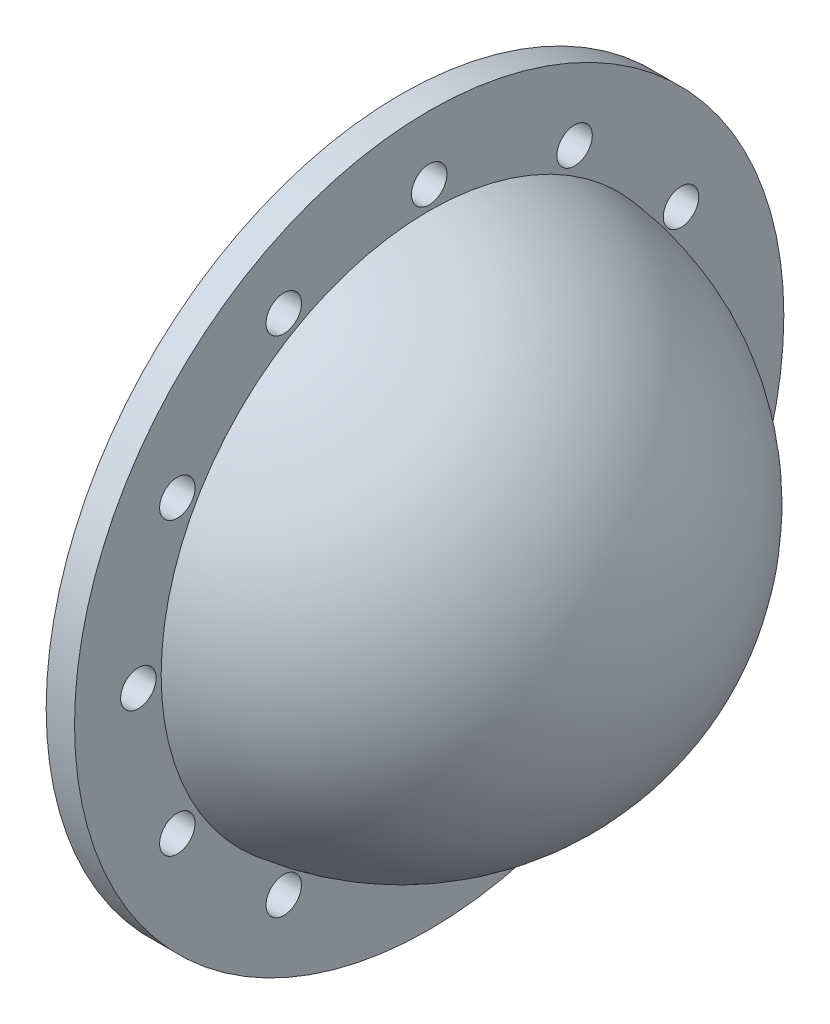
ISO-10303-21;
HEADER;
FILE_DESCRIPTION(('STEP AP214'),'2;1');
FILE_NAME('part.step','',(''),(''),'','','');
FILE_SCHEMA(('AUTOMOTIVE_DESIGN { 1 0 10303 214 1 1 1 1 }'));
ENDSEC;
DATA;
#1=APPLICATION_CONTEXT('core data for automotive mechanical design processes');
#2=APPLICATION_PROTOCOL_DEFINITION('international standard','automotive_design',2000,#1);
#3=PRODUCT_CONTEXT('',#1,'mechanical');
#4=PRODUCT('Part','Part','',(#3));
#5=PRODUCT_RELATED_PRODUCT_CATEGORY('part','',(#4));
#6=PRODUCT_DEFINITION_FORMATION('','',#4);
#7=PRODUCT_DEFINITION_CONTEXT('part definition',#1,'design');
#8=PRODUCT_DEFINITION('design','',#6,#7);
#9=PRODUCT_DEFINITION_SHAPE('','',#8);
#10=(LENGTH_UNIT() NAMED_UNIT(*) SI_UNIT(.MILLI.,.METRE.));
#11=(NAMED_UNIT(*) PLANE_ANGLE_UNIT() SI_UNIT($,.RADIAN.));
#12=(NAMED_UNIT(*) SI_UNIT($,.STERADIAN.) SOLID_ANGLE_UNIT());
#13=UNCERTAINTY_MEASURE_WITH_UNIT(LENGTH_MEASURE(1.E-05),#10,'distance_accuracy_value','');
#14=(GEOMETRIC_REPRESENTATION_CONTEXT(3) GLOBAL_UNCERTAINTY_ASSIGNED_CONTEXT((#13)) GLOBAL_UNIT_ASSIGNED_CONTEXT((#10,
#11,#12)) REPRESENTATION_CONTEXT('',''));
#15=CARTESIAN_POINT('',(0.,0.,0.));
#16=DIRECTION('',(0.,0.,1.));
#17=DIRECTION('',(1.,0.,0.));
#18=AXIS2_PLACEMENT_3D('',#15,#16,#17);
#19=CARTESIAN_POINT('',(200.,0.,0.));
#20=DIRECTION('',(1.,0.,0.));
#21=DIRECTION('',(0.,0.,-1.));
#22=AXIS2_PLACEMENT_3D('',#19,#20,#21);
#23=PLANE('',#22);
#24=CARTESIAN_POINT('',(200.,0.,0.));
#25=DIRECTION('',(1.,0.,0.));
#26=DIRECTION('',(0.,0.,-1.));
#27=AXIS2_PLACEMENT_3D('',#24,#25,#26);
#28=CIRCLE('',#27,1889.44436276912);
#29=CARTESIAN_POINT('',(200.,0.,-1889.44436276912));
#30=VERTEX_POINT('',#29);
#31=EDGE_CURVE('E11',#30,#30,#28,.T.);
#32=ORIENTED_EDGE('',*,*,#31,.F.);
#33=EDGE_LOOP('',(#32));
#34=FACE_BOUND('',#33,.T.);
#35=CARTESIAN_POINT('',(200.,1775.35207775805,1024.99999999999));
#36=DIRECTION('',(1.,0.,0.));
#37=DIRECTION('',(0.,0.,-1.));
#38=AXIS2_PLACEMENT_3D('',#35,#36,#37);
#39=CIRCLE('',#38,125.00000000005);
#40=CARTESIAN_POINT('',(200.,1775.35207775805,899.999999999939));
#41=VERTEX_POINT('',#40);
#42=EDGE_CURVE('E138',#41,#41,#39,.T.);
#43=ORIENTED_EDGE('',*,*,#42,.F.);
#44=EDGE_LOOP('',(#43));
#45=FACE_BOUND('',#44,.T.);
#46=CARTESIAN_POINT('',(200.,1775.3520777581,-1025.));
#47=DIRECTION('',(1.,0.,0.));
#48=DIRECTION('',(0.,0.,-1.));
#49=AXIS2_PLACEMENT_3D('',#46,#47,#48);
#50=CIRCLE('',#49,125.);
#51=CARTESIAN_POINT('',(200.,1775.3520777581,-1150.));
#52=VERTEX_POINT('',#51);
#53=EDGE_CURVE('E154',#52,#52,#50,.T.);
#54=ORIENTED_EDGE('',*,*,#53,.F.);
#55=EDGE_LOOP('',(#54));
#56=FACE_BOUND('',#55,.T.);
#57=CARTESIAN_POINT('',(200.,8.70201776077545E-11,-2050.00000000009));
#58=DIRECTION('',(1.,0.,0.));
#59=DIRECTION('',(0.,0.,-1.));
#60=AXIS2_PLACEMENT_3D('',#57,#58,#59);
#61=CIRCLE('',#60,125.000000000065);
#62=CARTESIAN_POINT('',(200.,8.70201776077545E-11,-2175.00000000015));
#63=VERTEX_POINT('',#62);
#64=EDGE_CURVE('E170',#63,#63,#61,.T.);
#65=ORIENTED_EDGE('',*,*,#64,.F.);
#66=EDGE_LOOP('',(#65));
#67=FACE_BOUND('',#66,.T.);
#68=CARTESIAN_POINT('',(200.,-1024.99999999992,-1775.35207775823));
#69=DIRECTION('',(1.,0.,0.));
#70=DIRECTION('',(0.,0.,-1.));
#71=AXIS2_PLACEMENT_3D('',#68,#69,#70);
#72=CIRCLE('',#71,125.000000000113);
#73=CARTESIAN_POINT('',(200.,-1024.99999999992,-1900.35207775834));
#74=VERTEX_POINT('',#73);
#75=EDGE_CURVE('E186',#74,#74,#72,.T.);
#76=ORIENTED_EDGE('',*,*,#75,.F.);
#77=EDGE_LOOP('',(#76));
#78=FACE_BOUND('',#77,.T.);
#79=CARTESIAN_POINT('',(200.,-1775.35207775814,1024.99999999984));
#80=DIRECTION('',(1.,0.,0.));
#81=DIRECTION('',(0.,0.,-1.));
#82=AXIS2_PLACEMENT_3D('',#79,#80,#81);
#83=CIRCLE('',#82,125.000000000185);
#84=CARTESIAN_POINT('',(200.,-1775.35207775814,899.999999999652));
#85=VERTEX_POINT('',#84);
#86=EDGE_CURVE('E202',#85,#85,#83,.T.);
#87=ORIENTED_EDGE('',*,*,#86,.F.);
#88=EDGE_LOOP('',(#87));
#89=FACE_BOUND('',#88,.T.);
#90=CARTESIAN_POINT('',(200.,-8.72712302015797E-11,2049.99999999991));
#91=DIRECTION('',(1.,0.,0.));
#92=DIRECTION('',(0.,0.,-1.));
#93=AXIS2_PLACEMENT_3D('',#90,#91,#92);
#94=CIRCLE('',#93,125.000000000129);
#95=CARTESIAN_POINT('',(200.,-8.72712302015797E-11,1924.99999999978));
#96=VERTEX_POINT('',#95);
#97=EDGE_CURVE('E218',#96,#96,#94,.T.);
#98=ORIENTED_EDGE('',*,*,#97,.F.);
#99=EDGE_LOOP('',(#98));
#100=FACE_BOUND('',#99,.T.);
#101=CARTESIAN_POINT('',(200.,0.,0.));
#102=DIRECTION('',(1.,0.,0.));
#103=DIRECTION('',(0.,0.,-1.));
#104=AXIS2_PLACEMENT_3D('',#101,#102,#103);
#105=CIRCLE('',#104,2500.);
#106=CARTESIAN_POINT('',(200.,0.,-2500.));
#107=VERTEX_POINT('',#106);
#108=EDGE_CURVE('E118',#107,#107,#105,.T.);
#109=ORIENTED_EDGE('',*,*,#108,.T.);
#110=EDGE_LOOP('',(#109));
#111=FACE_BOUND('',#110,.T.);
#112=CARTESIAN_POINT('',(200.,-1025.00000000008,1775.35207775797));
#113=DIRECTION('',(1.,0.,0.));
#114=DIRECTION('',(0.,0.,-1.));
#115=AXIS2_PLACEMENT_3D('',#112,#113,#114);
#116=CIRCLE('',#115,125.000000000165);
#117=CARTESIAN_POINT('',(200.,-1025.00000000008,1650.3520777578));
#118=VERTEX_POINT('',#117);
#119=EDGE_CURVE('E210',#118,#118,#116,.T.);
#120=ORIENTED_EDGE('',*,*,#119,.F.);
#121=EDGE_LOOP('',(#120));
#122=FACE_BOUND('',#121,.T.);
#123=CARTESIAN_POINT('',(200.,-2050.,-1.74040355215509E-10));
#124=DIRECTION('',(1.,0.,0.));
#125=DIRECTION('',(0.,0.,-1.));
#126=AXIS2_PLACEMENT_3D('',#123,#124,#125);
#127=CIRCLE('',#126,125.00000000018);
#128=CARTESIAN_POINT('',(200.,-2050.,-125.000000000354));
#129=VERTEX_POINT('',#128);
#130=EDGE_CURVE('E194',#129,#129,#127,.T.);
#131=ORIENTED_EDGE('',*,*,#130,.F.);
#132=EDGE_LOOP('',(#131));
#133=FACE_BOUND('',#132,.T.);
#134=CARTESIAN_POINT('',(200.,-1775.35207775806,-1025.00000000016));
#135=DIRECTION('',(1.,0.,0.));
#136=DIRECTION('',(0.,0.,-1.));
#137=AXIS2_PLACEMENT_3D('',#134,#135,#136);
#138=CIRCLE('',#137,125.000000000154);
#139=CARTESIAN_POINT('',(200.,-1775.35207775806,-1150.00000000032));
#140=VERTEX_POINT('',#139);
#141=EDGE_CURVE('E178',#140,#140,#138,.T.);
#142=ORIENTED_EDGE('',*,*,#141,.F.);
#143=EDGE_LOOP('',(#142));
#144=FACE_BOUND('',#143,.T.);
#145=CARTESIAN_POINT('',(200.,1025.00000000008,-1775.35207775814));
#146=DIRECTION('',(1.,0.,0.));
#147=DIRECTION('',(0.,0.,-1.));
#148=AXIS2_PLACEMENT_3D('',#145,#146,#147);
#149=CIRCLE('',#148,125.000000000025);
#150=CARTESIAN_POINT('',(200.,1025.00000000008,-1900.35207775817));
#151=VERTEX_POINT('',#150);
#152=EDGE_CURVE('E162',#151,#151,#149,.T.);
#153=ORIENTED_EDGE('',*,*,#152,.F.);
#154=EDGE_LOOP('',(#153));
#155=FACE_BOUND('',#154,.T.);
#156=CARTESIAN_POINT('',(200.,2050.,0.));
#157=DIRECTION('',(1.,0.,0.));
#158=DIRECTION('',(0.,0.,-1.));
#159=AXIS2_PLACEMENT_3D('',#156,#157,#158);
#160=CIRCLE('',#159,125.);
#161=CARTESIAN_POINT('',(200.,2050.,-125.));
#162=VERTEX_POINT('',#161);
#163=EDGE_CURVE('E146',#162,#162,#160,.T.);
#164=ORIENTED_EDGE('',*,*,#163,.F.);
#165=EDGE_LOOP('',(#164));
#166=FACE_BOUND('',#165,.T.);
#167=CARTESIAN_POINT('',(200.,1024.99999999992,1775.35207775806));
#168=DIRECTION('',(1.,0.,0.));
#169=DIRECTION('',(0.,0.,-1.));
#170=AXIS2_PLACEMENT_3D('',#167,#168,#169);
#171=CIRCLE('',#170,125.000000000088);
#172=CARTESIAN_POINT('',(200.,1024.99999999992,1650.35207775797));
#173=VERTEX_POINT('',#172);
#174=EDGE_CURVE('E130',#173,#173,#171,.T.);
#175=ORIENTED_EDGE('',*,*,#174,.F.);
#176=EDGE_LOOP('',(#175));
#177=FACE_BOUND('',#176,.T.);
#178=ADVANCED_FACE('F109',(#34,#45,#56,#67,#78,#89,#100,#111,#122,#133,#144,#155,#166,#177),#23,.T.);
#179=CARTESIAN_POINT('',(0.,0.,0.));
#180=DIRECTION('',(1.,0.,0.));
#181=DIRECTION('',(0.,0.,-1.));
#182=AXIS2_PLACEMENT_3D('',#179,#180,#181);
#183=PLANE('',#182);
#184=CARTESIAN_POINT('',(0.,0.,0.));
#185=DIRECTION('',(1.,0.,0.));
#186=DIRECTION('',(0.,0.,-1.));
#187=AXIS2_PLACEMENT_3D('',#184,#185,#186);
#188=CIRCLE('',#187,2500.);
#189=CARTESIAN_POINT('',(0.,0.,-2500.));
#190=VERTEX_POINT('',#189);
#191=EDGE_CURVE('E113',#190,#190,#188,.T.);
#192=ORIENTED_EDGE('',*,*,#191,.F.);
#193=EDGE_LOOP('',(#192));
#194=FACE_BOUND('',#193,.T.);
#195=CARTESIAN_POINT('',(0.,-8.72712302015797E-11,2049.99999999991));
#196=DIRECTION('',(1.,0.,0.));
#197=DIRECTION('',(0.,0.,-1.));
#198=AXIS2_PLACEMENT_3D('',#195,#196,#197);
#199=CIRCLE('',#198,125.000000000129);
#200=CARTESIAN_POINT('',(0.,-8.72712302015797E-11,1924.99999999978));
#201=VERTEX_POINT('',#200);
#202=EDGE_CURVE('E214',#201,#201,#199,.T.);
#203=ORIENTED_EDGE('',*,*,#202,.T.);
#204=EDGE_LOOP('',(#203));
#205=FACE_BOUND('',#204,.T.);
#206=CARTESIAN_POINT('',(0.,-1025.00000000008,1775.35207775797));
#207=DIRECTION('',(1.,0.,0.));
#208=DIRECTION('',(0.,0.,-1.));
#209=AXIS2_PLACEMENT_3D('',#206,#207,#208);
#210=CIRCLE('',#209,125.000000000165);
#211=CARTESIAN_POINT('',(0.,-1025.00000000008,1650.3520777578));
#212=VERTEX_POINT('',#211);
#213=EDGE_CURVE('E206',#212,#212,#210,.T.);
#214=ORIENTED_EDGE('',*,*,#213,.T.);
#215=EDGE_LOOP('',(#214));
#216=FACE_BOUND('',#215,.T.);
#217=CARTESIAN_POINT('',(0.,-1775.35207775814,1024.99999999984));
#218=DIRECTION('',(1.,0.,0.));
#219=DIRECTION('',(0.,0.,-1.));
#220=AXIS2_PLACEMENT_3D('',#217,#218,#219);
#221=CIRCLE('',#220,125.000000000185);
#222=CARTESIAN_POINT('',(0.,-1775.35207775814,899.999999999652));
#223=VERTEX_POINT('',#222);
#224=EDGE_CURVE('E198',#223,#223,#221,.T.);
#225=ORIENTED_EDGE('',*,*,#224,.T.);
#226=EDGE_LOOP('',(#225));
#227=FACE_BOUND('',#226,.T.);
#228=CARTESIAN_POINT('',(0.,-2050.,-1.74040355215509E-10));
#229=DIRECTION('',(1.,0.,0.));
#230=DIRECTION('',(0.,0.,-1.));
#231=AXIS2_PLACEMENT_3D('',#228,#229,#230);
#232=CIRCLE('',#231,125.00000000018);
#233=CARTESIAN_POINT('',(0.,-2050.,-125.000000000354));
#234=VERTEX_POINT('',#233);
#235=EDGE_CURVE('E190',#234,#234,#232,.T.);
#236=ORIENTED_EDGE('',*,*,#235,.T.);
#237=EDGE_LOOP('',(#236));
#238=FACE_BOUND('',#237,.T.);
#239=CARTESIAN_POINT('',(0.,-1024.99999999992,-1775.35207775823));
#240=DIRECTION('',(1.,0.,0.));
#241=DIRECTION('',(0.,0.,-1.));
#242=AXIS2_PLACEMENT_3D('',#239,#240,#241);
#243=CIRCLE('',#242,125.000000000113);
#244=CARTESIAN_POINT('',(0.,-1024.99999999992,-1900.35207775834));
#245=VERTEX_POINT('',#244);
#246=EDGE_CURVE('E182',#245,#245,#243,.T.);
#247=ORIENTED_EDGE('',*,*,#246,.T.);
#248=EDGE_LOOP('',(#247));
#249=FACE_BOUND('',#248,.T.);
#250=CARTESIAN_POINT('',(0.,-1775.35207775806,-1025.00000000016));
#251=DIRECTION('',(1.,0.,0.));
#252=DIRECTION('',(0.,0.,-1.));
#253=AXIS2_PLACEMENT_3D('',#250,#251,#252);
#254=CIRCLE('',#253,125.000000000154);
#255=CARTESIAN_POINT('',(0.,-1775.35207775806,-1150.00000000032));
#256=VERTEX_POINT('',#255);
#257=EDGE_CURVE('E174',#256,#256,#254,.T.);
#258=ORIENTED_EDGE('',*,*,#257,.T.);
#259=EDGE_LOOP('',(#258));
#260=FACE_BOUND('',#259,.T.);
#261=CARTESIAN_POINT('',(0.,8.70201776077545E-11,-2050.00000000009));
#262=DIRECTION('',(1.,0.,0.));
#263=DIRECTION('',(0.,0.,-1.));
#264=AXIS2_PLACEMENT_3D('',#261,#262,#263);
#265=CIRCLE('',#264,125.000000000065);
#266=CARTESIAN_POINT('',(0.,8.70201776077545E-11,-2175.00000000015));
#267=VERTEX_POINT('',#266);
#268=EDGE_CURVE('E166',#267,#267,#265,.T.);
#269=ORIENTED_EDGE('',*,*,#268,.T.);
#270=EDGE_LOOP('',(#269));
#271=FACE_BOUND('',#270,.T.);
#272=CARTESIAN_POINT('',(0.,1025.00000000008,-1775.35207775814));
#273=DIRECTION('',(1.,0.,0.));
#274=DIRECTION('',(0.,0.,-1.));
#275=AXIS2_PLACEMENT_3D('',#272,#273,#274);
#276=CIRCLE('',#275,125.000000000025);
#277=CARTESIAN_POINT('',(0.,1025.00000000008,-1900.35207775817));
#278=VERTEX_POINT('',#277);
#279=EDGE_CURVE('E158',#278,#278,#276,.T.);
#280=ORIENTED_EDGE('',*,*,#279,.T.);
#281=EDGE_LOOP('',(#280));
#282=FACE_BOUND('',#281,.T.);
#283=CARTESIAN_POINT('',(0.,1775.3520777581,-1025.));
#284=DIRECTION('',(1.,0.,0.));
#285=DIRECTION('',(0.,0.,-1.));
#286=AXIS2_PLACEMENT_3D('',#283,#284,#285);
#287=CIRCLE('',#286,125.);
#288=CARTESIAN_POINT('',(0.,1775.3520777581,-1150.));
#289=VERTEX_POINT('',#288);
#290=EDGE_CURVE('E150',#289,#289,#287,.T.);
#291=ORIENTED_EDGE('',*,*,#290,.T.);
#292=EDGE_LOOP('',(#291));
#293=FACE_BOUND('',#292,.T.);
#294=CARTESIAN_POINT('',(0.,2050.,0.));
#295=DIRECTION('',(1.,0.,0.));
#296=DIRECTION('',(0.,0.,-1.));
#297=AXIS2_PLACEMENT_3D('',#294,#295,#296);
#298=CIRCLE('',#297,125.);
#299=CARTESIAN_POINT('',(0.,2050.,-125.));
#300=VERTEX_POINT('',#299);
#301=EDGE_CURVE('E142',#300,#300,#298,.T.);
#302=ORIENTED_EDGE('',*,*,#301,.T.);
#303=EDGE_LOOP('',(#302));
#304=FACE_BOUND('',#303,.T.);
#305=CARTESIAN_POINT('',(0.,1775.35207775805,1024.99999999999));
#306=DIRECTION('',(1.,0.,0.));
#307=DIRECTION('',(0.,0.,-1.));
#308=AXIS2_PLACEMENT_3D('',#305,#306,#307);
#309=CIRCLE('',#308,125.00000000005);
#310=CARTESIAN_POINT('',(0.,1775.35207775805,899.999999999939));
#311=VERTEX_POINT('',#310);
#312=EDGE_CURVE('E134',#311,#311,#309,.T.);
#313=ORIENTED_EDGE('',*,*,#312,.T.);
#314=EDGE_LOOP('',(#313));
#315=FACE_BOUND('',#314,.T.);
#316=CARTESIAN_POINT('',(0.,1024.99999999992,1775.35207775806));
#317=DIRECTION('',(1.,0.,0.));
#318=DIRECTION('',(0.,0.,-1.));
#319=AXIS2_PLACEMENT_3D('',#316,#317,#318);
#320=CIRCLE('',#319,125.000000000088);
#321=CARTESIAN_POINT('',(0.,1024.99999999992,1650.35207775797));
#322=VERTEX_POINT('',#321);
#323=EDGE_CURVE('E129',#322,#322,#320,.T.);
#324=ORIENTED_EDGE('',*,*,#323,.T.);
#325=EDGE_LOOP('',(#324));
#326=FACE_BOUND('',#325,.T.);
#327=CARTESIAN_POINT('',(0.,0.,0.));
#328=DIRECTION('',(-1.,0.,0.));
#329=DIRECTION('',(0.,0.,1.));
#330=AXIS2_PLACEMENT_3D('',#327,#328,#329);
#331=CIRCLE('',#330,1800.);
#332=CARTESIAN_POINT('',(0.,0.,1800.));
#333=VERTEX_POINT('',#332);
#334=EDGE_CURVE('E125',#333,#333,#331,.T.);
#335=ORIENTED_EDGE('',*,*,#334,.F.);
#336=EDGE_LOOP('',(#335));
#337=FACE_BOUND('',#336,.T.);
#338=ADVANCED_FACE('F226',(#194,#205,#216,#227,#238,#249,#260,#271,#282,#293,#304,#315,#326,
#337),#183,.F.);
#339=CARTESIAN_POINT('',(200.,0.,0.));
#340=DIRECTION('',(-1.,0.,0.));
#341=DIRECTION('',(0.,0.,1.));
#342=AXIS2_PLACEMENT_3D('',#339,#340,#341);
#343=CYLINDRICAL_SURFACE('',#342,2500.);
#344=ORIENTED_EDGE('',*,*,#108,.F.);
#345=EDGE_LOOP('',(#344));
#346=FACE_BOUND('',#345,.T.);
#347=ORIENTED_EDGE('',*,*,#191,.T.);
#348=EDGE_LOOP('',(#347));
#349=FACE_BOUND('',#348,.T.);
#350=ADVANCED_FACE('F111',(#346,#349),#343,.T.);
#351=CARTESIAN_POINT('',(200.,-8.72712302015797E-11,2049.99999999991));
#352=DIRECTION('',(-1.,0.,0.));
#353=DIRECTION('',(0.,0.,1.));
#354=AXIS2_PLACEMENT_3D('',#351,#352,#353);
#355=CYLINDRICAL_SURFACE('',#354,125.000000000129);
#356=ORIENTED_EDGE('',*,*,#97,.T.);
#357=EDGE_LOOP('',(#356));
#358=FACE_BOUND('',#357,.T.);
#359=ORIENTED_EDGE('',*,*,#202,.F.);
#360=EDGE_LOOP('',(#359));
#361=FACE_BOUND('',#360,.T.);
#362=ADVANCED_FACE('F229',(#358,#361),#355,.F.);
#363=CARTESIAN_POINT('',(200.,-1025.00000000008,1775.35207775797));
#364=DIRECTION('',(-1.,0.,0.));
#365=DIRECTION('',(0.,0.,1.));
#366=AXIS2_PLACEMENT_3D('',#363,#364,#365);
#367=CYLINDRICAL_SURFACE('',#366,125.000000000165);
#368=ORIENTED_EDGE('',*,*,#119,.T.);
#369=EDGE_LOOP('',(#368));
#370=FACE_BOUND('',#369,.T.);
#371=ORIENTED_EDGE('',*,*,#213,.F.);
#372=EDGE_LOOP('',(#371));
#373=FACE_BOUND('',#372,.T.);
#374=ADVANCED_FACE('F231',(#370,#373),#367,.F.);
#375=CARTESIAN_POINT('',(200.,-1775.35207775814,1024.99999999984));
#376=DIRECTION('',(-1.,0.,0.));
#377=DIRECTION('',(0.,0.,1.));
#378=AXIS2_PLACEMENT_3D('',#375,#376,#377);
#379=CYLINDRICAL_SURFACE('',#378,125.000000000185);
#380=ORIENTED_EDGE('',*,*,#86,.T.);
#381=EDGE_LOOP('',(#380));
#382=FACE_BOUND('',#381,.T.);
#383=ORIENTED_EDGE('',*,*,#224,.F.);
#384=EDGE_LOOP('',(#383));
#385=FACE_BOUND('',#384,.T.);
#386=ADVANCED_FACE('F238',(#382,#385),#379,.F.);
#387=CARTESIAN_POINT('',(200.,-2050.,-1.74040355215509E-10));
#388=DIRECTION('',(-1.,0.,0.));
#389=DIRECTION('',(0.,0.,1.));
#390=AXIS2_PLACEMENT_3D('',#387,#388,#389);
#391=CYLINDRICAL_SURFACE('',#390,125.00000000018);
#392=ORIENTED_EDGE('',*,*,#130,.T.);
#393=EDGE_LOOP('',(#392));
#394=FACE_BOUND('',#393,.T.);
#395=ORIENTED_EDGE('',*,*,#235,.F.);
#396=EDGE_LOOP('',(#395));
#397=FACE_BOUND('',#396,.T.);
#398=ADVANCED_FACE('F321',(#394,#397),#391,.F.);
#399=CARTESIAN_POINT('',(200.,-1024.99999999992,-1775.35207775823));
#400=DIRECTION('',(-1.,0.,0.));
#401=DIRECTION('',(0.,0.,1.));
#402=AXIS2_PLACEMENT_3D('',#399,#400,#401);
#403=CYLINDRICAL_SURFACE('',#402,125.000000000113);
#404=ORIENTED_EDGE('',*,*,#75,.T.);
#405=EDGE_LOOP('',(#404));
#406=FACE_BOUND('',#405,.T.);
#407=ORIENTED_EDGE('',*,*,#246,.F.);
#408=EDGE_LOOP('',(#407));
#409=FACE_BOUND('',#408,.T.);
#410=ADVANCED_FACE('F317',(#406,#409),#403,.F.);
#411=CARTESIAN_POINT('',(200.,-1775.35207775806,-1025.00000000016));
#412=DIRECTION('',(-1.,0.,0.));
#413=DIRECTION('',(0.,0.,1.));
#414=AXIS2_PLACEMENT_3D('',#411,#412,#413);
#415=CYLINDRICAL_SURFACE('',#414,125.000000000154);
#416=ORIENTED_EDGE('',*,*,#141,.T.);
#417=EDGE_LOOP('',(#416));
#418=FACE_BOUND('',#417,.T.);
#419=ORIENTED_EDGE('',*,*,#257,.F.);
#420=EDGE_LOOP('',(#419));
#421=FACE_BOUND('',#420,.T.);
#422=ADVANCED_FACE('F313',(#418,#421),#415,.F.);
#423=CARTESIAN_POINT('',(200.,8.70201776077545E-11,-2050.00000000009));
#424=DIRECTION('',(-1.,0.,0.));
#425=DIRECTION('',(0.,0.,1.));
#426=AXIS2_PLACEMENT_3D('',#423,#424,#425);
#427=CYLINDRICAL_SURFACE('',#426,125.000000000065);
#428=ORIENTED_EDGE('',*,*,#64,.T.);
#429=EDGE_LOOP('',(#428));
#430=FACE_BOUND('',#429,.T.);
#431=ORIENTED_EDGE('',*,*,#268,.F.);
#432=EDGE_LOOP('',(#431));
#433=FACE_BOUND('',#432,.T.);
#434=ADVANCED_FACE('F309',(#430,#433),#427,.F.);
#435=CARTESIAN_POINT('',(200.,1025.00000000008,-1775.35207775814));
#436=DIRECTION('',(-1.,0.,0.));
#437=DIRECTION('',(0.,0.,1.));
#438=AXIS2_PLACEMENT_3D('',#435,#436,#437);
#439=CYLINDRICAL_SURFACE('',#438,125.000000000025);
#440=ORIENTED_EDGE('',*,*,#152,.T.);
#441=EDGE_LOOP('',(#440));
#442=FACE_BOUND('',#441,.T.);
#443=ORIENTED_EDGE('',*,*,#279,.F.);
#444=EDGE_LOOP('',(#443));
#445=FACE_BOUND('',#444,.T.);
#446=ADVANCED_FACE('F305',(#442,#445),#439,.F.);
#447=CARTESIAN_POINT('',(200.,1775.3520777581,-1025.));
#448=DIRECTION('',(-1.,0.,0.));
#449=DIRECTION('',(0.,0.,1.));
#450=AXIS2_PLACEMENT_3D('',#447,#448,#449);
#451=CYLINDRICAL_SURFACE('',#450,125.);
#452=ORIENTED_EDGE('',*,*,#53,.T.);
#453=EDGE_LOOP('',(#452));
#454=FACE_BOUND('',#453,.T.);
#455=ORIENTED_EDGE('',*,*,#290,.F.);
#456=EDGE_LOOP('',(#455));
#457=FACE_BOUND('',#456,.T.);
#458=ADVANCED_FACE('F301',(#454,#457),#451,.F.);
#459=CARTESIAN_POINT('',(200.,2050.,0.));
#460=DIRECTION('',(-1.,0.,0.));
#461=DIRECTION('',(0.,0.,1.));
#462=AXIS2_PLACEMENT_3D('',#459,#460,#461);
#463=CYLINDRICAL_SURFACE('',#462,125.);
#464=ORIENTED_EDGE('',*,*,#163,.T.);
#465=EDGE_LOOP('',(#464));
#466=FACE_BOUND('',#465,.T.);
#467=ORIENTED_EDGE('',*,*,#301,.F.);
#468=EDGE_LOOP('',(#467));
#469=FACE_BOUND('',#468,.T.);
#470=ADVANCED_FACE('F297',(#466,#469),#463,.F.);
#471=CARTESIAN_POINT('',(200.,1775.35207775805,1024.99999999999));
#472=DIRECTION('',(-1.,0.,0.));
#473=DIRECTION('',(0.,0.,1.));
#474=AXIS2_PLACEMENT_3D('',#471,#472,#473);
#475=CYLINDRICAL_SURFACE('',#474,125.00000000005);
#476=ORIENTED_EDGE('',*,*,#42,.T.);
#477=EDGE_LOOP('',(#476));
#478=FACE_BOUND('',#477,.T.);
#479=ORIENTED_EDGE('',*,*,#312,.F.);
#480=EDGE_LOOP('',(#479));
#481=FACE_BOUND('',#480,.T.);
#482=ADVANCED_FACE('F280',(#478,#481),#475,.F.);
#483=CARTESIAN_POINT('',(200.,1024.99999999992,1775.35207775806));
#484=DIRECTION('',(-1.,0.,0.));
#485=DIRECTION('',(0.,0.,1.));
#486=AXIS2_PLACEMENT_3D('',#483,#484,#485);
#487=CYLINDRICAL_SURFACE('',#486,125.000000000088);
#488=ORIENTED_EDGE('',*,*,#174,.T.);
#489=EDGE_LOOP('',(#488));
#490=FACE_BOUND('',#489,.T.);
#491=ORIENTED_EDGE('',*,*,#323,.F.);
#492=EDGE_LOOP('',(#491));
#493=FACE_BOUND('',#492,.T.);
#494=ADVANCED_FACE('F276',(#490,#493),#487,.F.);
#495=CARTESIAN_POINT('',(0.,0.,0.));
#496=DIRECTION('',(0.,-1.,0.));
#497=DIRECTION('',(0.,0.,-1.));
#498=AXIS2_PLACEMENT_3D('',#495,#496,#497);
#499=SPHERICAL_SURFACE('',#498,1800.);
#500=CARTESIAN_POINT('',(0.,0.,0.));
#501=DIRECTION('',(-1.,0.,0.));
#502=DIRECTION('',(0.,0.,1.));
#503=AXIS2_PLACEMENT_3D('',#500,#501,#502);
#504=SPHERICAL_SURFACE('',#503,1800.);
#505=ORIENTED_EDGE('',*,*,#334,.T.);
#506=EDGE_LOOP('',(#505));
#507=FACE_BOUND('',#506,.T.);
#508=ADVANCED_FACE('F279',(#507),#504,.F.);
#509=CARTESIAN_POINT('',(0.,0.,0.));
#510=DIRECTION('',(0.,-1.,0.));
#511=DIRECTION('',(0.,0.,1.));
#512=AXIS2_PLACEMENT_3D('',#509,#510,#511);
#513=SPHERICAL_SURFACE('',#512,1900.);
#514=CARTESIAN_POINT('',(0.,0.,0.));
#515=DIRECTION('',(1.,0.,0.));
#516=DIRECTION('',(0.,0.,-1.));
#517=AXIS2_PLACEMENT_3D('',#514,#515,#516);
#518=SPHERICAL_SURFACE('',#517,1900.);
#519=ORIENTED_EDGE('',*,*,#31,.T.);
#520=EDGE_LOOP('',(#519));
#521=FACE_BOUND('',#520,.T.);
#522=ADVANCED_FACE('F288',(#521),#518,.T.);
#523=CLOSED_SHELL('',(#178,#338,#350,#362,#374,#386,#398,#410,#422,#434,#446,#458,#470,#482,
#494,#508,#522));
#524=MANIFOLD_SOLID_BREP('B2',#523);
#525=ADVANCED_BREP_SHAPE_REPRESENTATION('',(#18,#524),#14);
#526=SHAPE_DEFINITION_REPRESENTATION(#9,#525);
ENDSEC;
END-ISO-10303-21;
